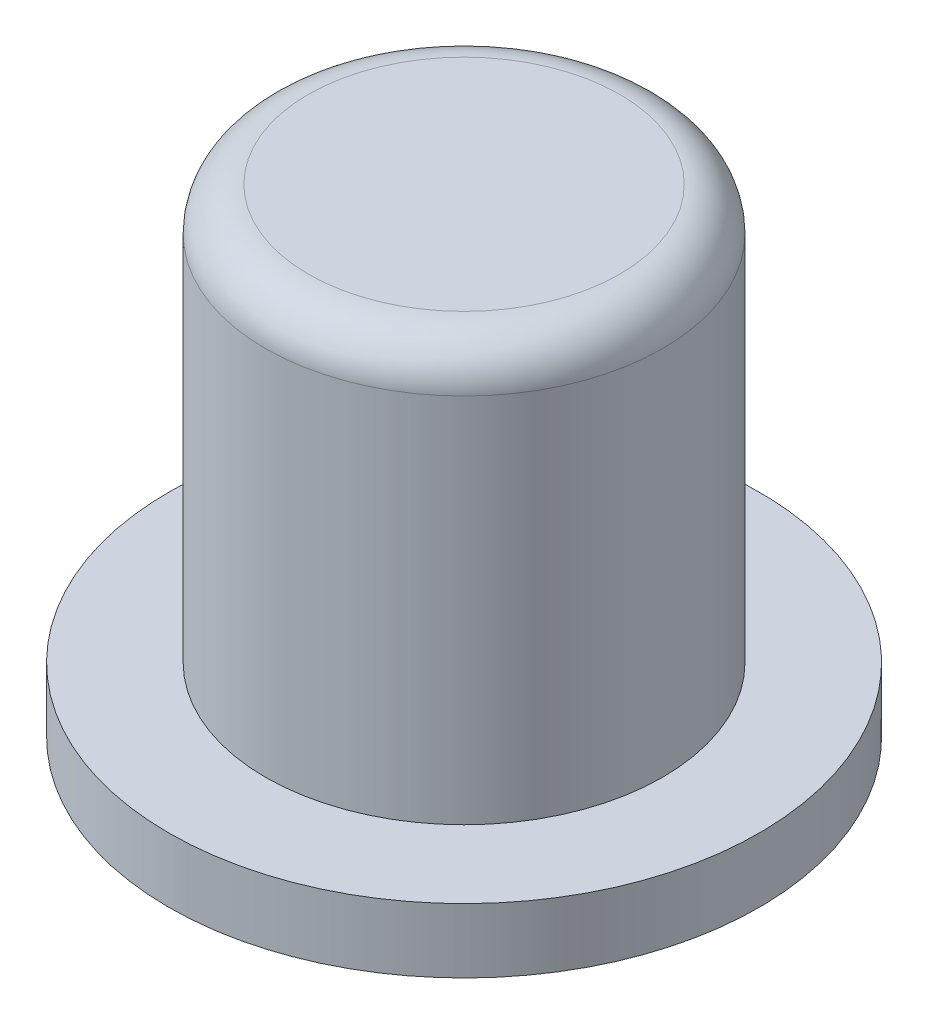
ISO-10303-21;
HEADER;
FILE_DESCRIPTION(('STEP AP214'),'2;1');
FILE_NAME('part.step','',(''),(''),'','','');
FILE_SCHEMA(('AUTOMOTIVE_DESIGN { 1 0 10303 214 1 1 1 1 }'));
ENDSEC;
DATA;
#1=APPLICATION_CONTEXT('core data for automotive mechanical design processes');
#2=APPLICATION_PROTOCOL_DEFINITION('international standard','automotive_design',2000,#1);
#3=PRODUCT_CONTEXT('',#1,'mechanical');
#4=PRODUCT('Part','Part','',(#3));
#5=PRODUCT_RELATED_PRODUCT_CATEGORY('part','',(#4));
#6=PRODUCT_DEFINITION_FORMATION('','',#4);
#7=PRODUCT_DEFINITION_CONTEXT('part definition',#1,'design');
#8=PRODUCT_DEFINITION('design','',#6,#7);
#9=PRODUCT_DEFINITION_SHAPE('','',#8);
#10=(LENGTH_UNIT() NAMED_UNIT(*) SI_UNIT(.MILLI.,.METRE.));
#11=(NAMED_UNIT(*) PLANE_ANGLE_UNIT() SI_UNIT($,.RADIAN.));
#12=(NAMED_UNIT(*) SI_UNIT($,.STERADIAN.) SOLID_ANGLE_UNIT());
#13=UNCERTAINTY_MEASURE_WITH_UNIT(LENGTH_MEASURE(1.E-05),#10,'distance_accuracy_value','');
#14=(GEOMETRIC_REPRESENTATION_CONTEXT(3) GLOBAL_UNCERTAINTY_ASSIGNED_CONTEXT((#13)) GLOBAL_UNIT_ASSIGNED_CONTEXT((#10,
#11,#12)) REPRESENTATION_CONTEXT('',''));
#15=CARTESIAN_POINT('',(0.,0.,0.));
#16=DIRECTION('',(0.,0.,1.));
#17=DIRECTION('',(1.,0.,0.));
#18=AXIS2_PLACEMENT_3D('',#15,#16,#17);
#19=CARTESIAN_POINT('',(0.,0.762,0.));
#20=DIRECTION('',(0.,-1.,0.));
#21=DIRECTION('',(0.,0.,-1.));
#22=AXIS2_PLACEMENT_3D('',#19,#20,#21);
#23=CYLINDRICAL_SURFACE('',#22,3.4925);
#24=CARTESIAN_POINT('',(0.,0.762,0.));
#25=DIRECTION('',(0.,1.,0.));
#26=DIRECTION('',(0.,0.,1.));
#27=AXIS2_PLACEMENT_3D('',#24,#25,#26);
#28=CIRCLE('',#27,3.4925);
#29=CARTESIAN_POINT('',(0.,0.762,3.4925));
#30=VERTEX_POINT('',#29);
#31=EDGE_CURVE('E47',#30,#30,#28,.T.);
#32=ORIENTED_EDGE('',*,*,#31,.F.);
#33=EDGE_LOOP('',(#32));
#34=FACE_BOUND('',#33,.T.);
#35=CARTESIAN_POINT('',(0.,0.,0.));
#36=DIRECTION('',(0.,1.,0.));
#37=DIRECTION('',(0.,0.,1.));
#38=AXIS2_PLACEMENT_3D('',#35,#36,#37);
#39=CIRCLE('',#38,3.4925);
#40=CARTESIAN_POINT('',(0.,0.,3.4925));
#41=VERTEX_POINT('',#40);
#42=EDGE_CURVE('E50',#41,#41,#39,.T.);
#43=ORIENTED_EDGE('',*,*,#42,.T.);
#44=EDGE_LOOP('',(#43));
#45=FACE_BOUND('',#44,.T.);
#46=ADVANCED_FACE('F32',(#34,#45),#23,.T.);
#47=CARTESIAN_POINT('',(0.,0.762,0.));
#48=DIRECTION('',(0.,1.,0.));
#49=DIRECTION('',(0.,0.,1.));
#50=AXIS2_PLACEMENT_3D('',#47,#48,#49);
#51=PLANE('',#50);
#52=CARTESIAN_POINT('',(0.,0.762,0.));
#53=DIRECTION('',(0.,1.,0.));
#54=DIRECTION('',(0.,0.,1.));
#55=AXIS2_PLACEMENT_3D('',#52,#53,#54);
#56=CIRCLE('',#55,2.35);
#57=CARTESIAN_POINT('',(0.,0.762,2.35));
#58=VERTEX_POINT('',#57);
#59=EDGE_CURVE('E43',#58,#58,#56,.T.);
#60=ORIENTED_EDGE('',*,*,#59,.F.);
#61=EDGE_LOOP('',(#60));
#62=FACE_BOUND('',#61,.T.);
#63=ORIENTED_EDGE('',*,*,#31,.T.);
#64=EDGE_LOOP('',(#63));
#65=FACE_BOUND('',#64,.T.);
#66=ADVANCED_FACE('F56',(#62,#65),#51,.T.);
#67=CARTESIAN_POINT('',(0.,0.,0.));
#68=DIRECTION('',(0.,1.,0.));
#69=DIRECTION('',(0.,0.,1.));
#70=AXIS2_PLACEMENT_3D('',#67,#68,#69);
#71=PLANE('',#70);
#72=ORIENTED_EDGE('',*,*,#42,.F.);
#73=EDGE_LOOP('',(#72));
#74=FACE_BOUND('',#73,.T.);
#75=ADVANCED_FACE('F62',(#74),#71,.F.);
#76=CARTESIAN_POINT('',(0.,5.662,0.));
#77=DIRECTION('',(0.,-1.,0.));
#78=DIRECTION('',(0.,0.,-1.));
#79=AXIS2_PLACEMENT_3D('',#76,#77,#78);
#80=CYLINDRICAL_SURFACE('',#79,2.35);
#81=CARTESIAN_POINT('',(0.,5.154,0.));
#82=DIRECTION('',(0.,1.,0.));
#83=DIRECTION('',(0.,0.,1.));
#84=AXIS2_PLACEMENT_3D('',#81,#82,#83);
#85=CIRCLE('',#84,2.35);
#86=CARTESIAN_POINT('',(0.,5.154,2.35));
#87=VERTEX_POINT('',#86);
#88=EDGE_CURVE('E10',#87,#87,#85,.F.);
#89=ORIENTED_EDGE('',*,*,#88,.T.);
#90=EDGE_LOOP('',(#89));
#91=FACE_BOUND('',#90,.T.);
#92=ORIENTED_EDGE('',*,*,#59,.T.);
#93=EDGE_LOOP('',(#92));
#94=FACE_BOUND('',#93,.T.);
#95=ADVANCED_FACE('F64',(#91,#94),#80,.T.);
#96=CARTESIAN_POINT('',(0.,5.662,0.));
#97=DIRECTION('',(0.,1.,0.));
#98=DIRECTION('',(0.,0.,1.));
#99=AXIS2_PLACEMENT_3D('',#96,#97,#98);
#100=PLANE('',#99);
#101=CARTESIAN_POINT('',(0.,5.662,0.));
#102=DIRECTION('',(0.,1.,0.));
#103=DIRECTION('',(0.,0.,1.));
#104=AXIS2_PLACEMENT_3D('',#101,#102,#103);
#105=CIRCLE('',#104,1.842);
#106=CARTESIAN_POINT('',(0.,5.662,1.842));
#107=VERTEX_POINT('',#106);
#108=EDGE_CURVE('E39',#107,#107,#105,.T.);
#109=ORIENTED_EDGE('',*,*,#108,.T.);
#110=EDGE_LOOP('',(#109));
#111=FACE_BOUND('',#110,.T.);
#112=ADVANCED_FACE('F70',(#111),#100,.T.);
#113=CARTESIAN_POINT('',(0.,5.154,0.));
#114=DIRECTION('',(0.,1.,0.));
#115=DIRECTION('',(0.,0.,1.));
#116=AXIS2_PLACEMENT_3D('',#113,#114,#115);
#117=TOROIDAL_SURFACE('',#116,1.842,0.508);
#118=ORIENTED_EDGE('',*,*,#88,.F.);
#119=EDGE_LOOP('',(#118));
#120=FACE_BOUND('',#119,.T.);
#121=ORIENTED_EDGE('',*,*,#108,.F.);
#122=EDGE_LOOP('',(#121));
#123=FACE_BOUND('',#122,.T.);
#124=ADVANCED_FACE('F34',(#120,#123),#117,.T.);
#125=CLOSED_SHELL('',(#46,#66,#75,#95,#112,#124));
#126=MANIFOLD_SOLID_BREP('B2',#125);
#127=ADVANCED_BREP_SHAPE_REPRESENTATION('',(#18,#126),#14);
#128=SHAPE_DEFINITION_REPRESENTATION(#9,#127);
ENDSEC;
END-ISO-10303-21;
